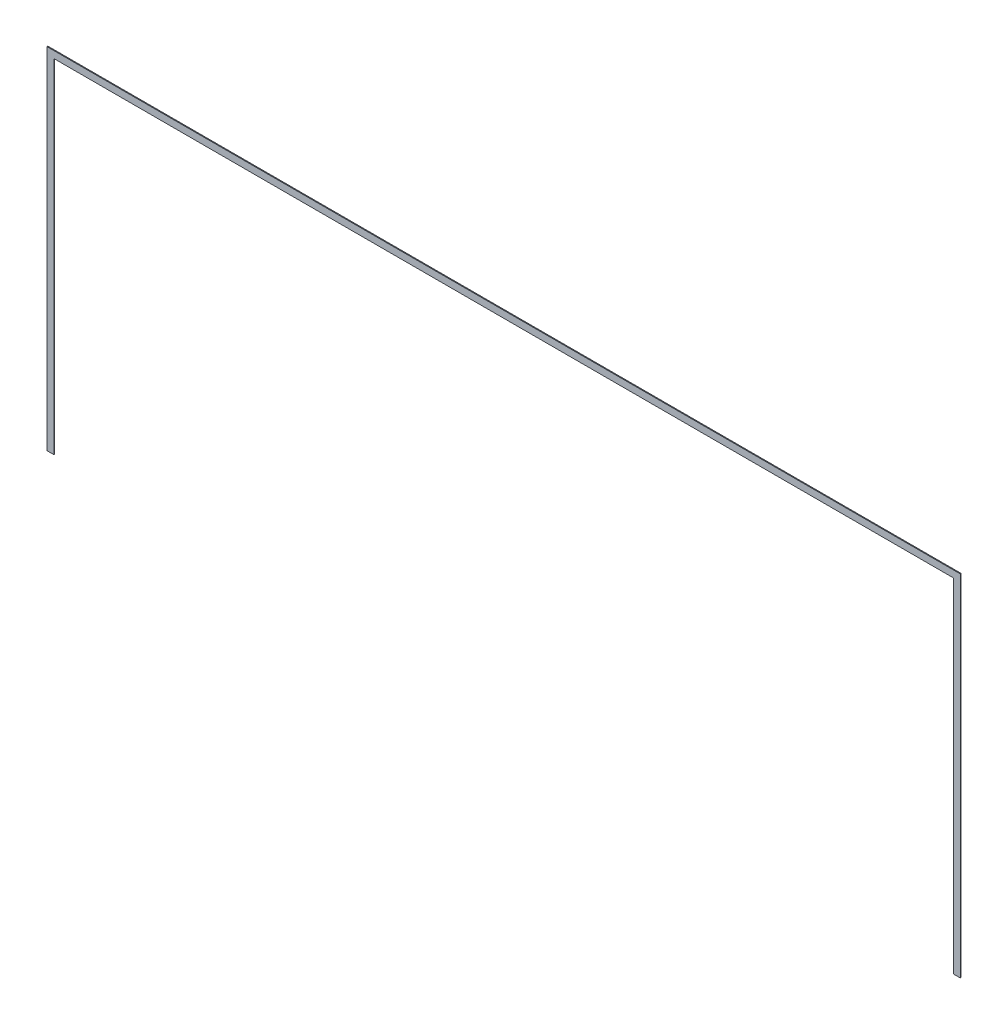
ISO-10303-21;
HEADER;
FILE_DESCRIPTION(('STEP AP214'),'2;1');
FILE_NAME('part.step','',(''),(''),'','','');
FILE_SCHEMA(('AUTOMOTIVE_DESIGN { 1 0 10303 214 1 1 1 1 }'));
ENDSEC;
DATA;
#1=APPLICATION_CONTEXT('core data for automotive mechanical design processes');
#2=APPLICATION_PROTOCOL_DEFINITION('international standard','automotive_design',2000,#1);
#3=PRODUCT_CONTEXT('',#1,'mechanical');
#4=PRODUCT('Part','Part','',(#3));
#5=PRODUCT_RELATED_PRODUCT_CATEGORY('part','',(#4));
#6=PRODUCT_DEFINITION_FORMATION('','',#4);
#7=PRODUCT_DEFINITION_CONTEXT('part definition',#1,'design');
#8=PRODUCT_DEFINITION('design','',#6,#7);
#9=PRODUCT_DEFINITION_SHAPE('','',#8);
#10=(LENGTH_UNIT() NAMED_UNIT(*) SI_UNIT(.MILLI.,.METRE.));
#11=(NAMED_UNIT(*) PLANE_ANGLE_UNIT() SI_UNIT($,.RADIAN.));
#12=(NAMED_UNIT(*) SI_UNIT($,.STERADIAN.) SOLID_ANGLE_UNIT());
#13=UNCERTAINTY_MEASURE_WITH_UNIT(LENGTH_MEASURE(1.E-05),#10,'distance_accuracy_value','');
#14=(GEOMETRIC_REPRESENTATION_CONTEXT(3) GLOBAL_UNCERTAINTY_ASSIGNED_CONTEXT((#13)) GLOBAL_UNIT_ASSIGNED_CONTEXT((#10,
#11,#12)) REPRESENTATION_CONTEXT('',''));
#15=CARTESIAN_POINT('',(0.,0.,0.));
#16=DIRECTION('',(0.,0.,1.));
#17=DIRECTION('',(1.,0.,0.));
#18=AXIS2_PLACEMENT_3D('',#15,#16,#17);
#19=CARTESIAN_POINT('',(-960.950136184693,7020.97074050903,0.));
#20=DIRECTION('',(0.,0.,1.));
#21=DIRECTION('',(1.,0.,0.));
#22=AXIS2_PLACEMENT_3D('',#19,#20,#21);
#23=PLANE('',#22);
#24=DIRECTION('',(1.,0.,0.));
#25=VECTOR('',#24,1.);
#26=CARTESIAN_POINT('',(-960.950136184693,8303.67074050903,0.));
#27=LINE('',#26,#25);
#28=CARTESIAN_POINT('',(2387.08736381531,8303.67074050903,0.));
#29=VERTEX_POINT('',#28);
#30=CARTESIAN_POINT('',(-4308.9876361847,8303.67074050903,0.));
#31=VERTEX_POINT('',#30);
#32=EDGE_CURVE('E124',#29,#31,#27,.F.);
#33=ORIENTED_EDGE('',*,*,#32,.F.);
#34=DIRECTION('',(0.,1.,0.));
#35=VECTOR('',#34,1.);
#36=CARTESIAN_POINT('',(2387.08736381531,7020.97074050903,0.));
#37=LINE('',#36,#35);
#38=CARTESIAN_POINT('',(2387.08736381531,5738.27074050903,0.));
#39=VERTEX_POINT('',#38);
#40=EDGE_CURVE('E119',#39,#29,#37,.T.);
#41=ORIENTED_EDGE('',*,*,#40,.F.);
#42=DIRECTION('',(1.,0.,0.));
#43=VECTOR('',#42,1.);
#44=CARTESIAN_POINT('',(2361.68736381531,5738.27074050903,0.));
#45=LINE('',#44,#43);
#46=CARTESIAN_POINT('',(2336.28736381531,5738.27074050903,0.));
#47=VERTEX_POINT('',#46);
#48=EDGE_CURVE('E113',#47,#39,#45,.T.);
#49=ORIENTED_EDGE('',*,*,#48,.F.);
#50=DIRECTION('',(0.,1.,0.));
#51=VECTOR('',#50,1.);
#52=CARTESIAN_POINT('',(2336.28736381531,6995.57074050903,0.));
#53=LINE('',#52,#51);
#54=CARTESIAN_POINT('',(2336.2873638153,8252.87074050903,0.));
#55=VERTEX_POINT('',#54);
#56=EDGE_CURVE('E107',#55,#47,#53,.F.);
#57=ORIENTED_EDGE('',*,*,#56,.F.);
#58=DIRECTION('',(1.,0.,0.));
#59=VECTOR('',#58,1.);
#60=CARTESIAN_POINT('',(-960.950136184693,8252.87074050903,0.));
#61=LINE('',#60,#59);
#62=CARTESIAN_POINT('',(-4258.1876361847,8252.87074050903,0.));
#63=VERTEX_POINT('',#62);
#64=EDGE_CURVE('E101',#63,#55,#61,.T.);
#65=ORIENTED_EDGE('',*,*,#64,.F.);
#66=DIRECTION('',(0.,1.,0.));
#67=VECTOR('',#66,1.);
#68=CARTESIAN_POINT('',(-4258.1876361847,6995.57074050903,0.));
#69=LINE('',#68,#67);
#70=CARTESIAN_POINT('',(-4258.1876361847,5738.27074050903,0.));
#71=VERTEX_POINT('',#70);
#72=EDGE_CURVE('E77',#71,#63,#69,.T.);
#73=ORIENTED_EDGE('',*,*,#72,.F.);
#74=DIRECTION('',(1.,0.,0.));
#75=VECTOR('',#74,1.);
#76=CARTESIAN_POINT('',(-4283.5876361847,5738.27074050903,0.));
#77=LINE('',#76,#75);
#78=CARTESIAN_POINT('',(-4308.9876361847,5738.27074050903,0.));
#79=VERTEX_POINT('',#78);
#80=EDGE_CURVE('E79',#79,#71,#77,.T.);
#81=ORIENTED_EDGE('',*,*,#80,.F.);
#82=DIRECTION('',(0.,1.,0.));
#83=VECTOR('',#82,1.);
#84=CARTESIAN_POINT('',(-4308.9876361847,7020.97074050903,0.));
#85=LINE('',#84,#83);
#86=EDGE_CURVE('E17',#31,#79,#85,.F.);
#87=ORIENTED_EDGE('',*,*,#86,.F.);
#88=EDGE_LOOP('',(#33,#41,#49,#57,#65,#73,#81,#87));
#89=FACE_BOUND('',#88,.T.);
#90=ADVANCED_FACE('F14',(#89),#23,.F.);
#91=CARTESIAN_POINT('',(-4308.9876361847,7020.97074050903,6.35));
#92=DIRECTION('',(-1.,0.,0.));
#93=DIRECTION('',(0.,0.,1.));
#94=AXIS2_PLACEMENT_3D('',#91,#92,#93);
#95=PLANE('',#94);
#96=DIRECTION('',(0.,1.,0.));
#97=VECTOR('',#96,1.);
#98=CARTESIAN_POINT('',(-4308.9876361847,7020.97074050903,6.35));
#99=LINE('',#98,#97);
#100=CARTESIAN_POINT('',(-4308.9876361847,8303.67074050903,6.35));
#101=VERTEX_POINT('',#100);
#102=CARTESIAN_POINT('',(-4308.9876361847,5738.27074050903,6.35));
#103=VERTEX_POINT('',#102);
#104=EDGE_CURVE('E128',#101,#103,#99,.F.);
#105=ORIENTED_EDGE('',*,*,#104,.F.);
#106=DIRECTION('',(0.,0.,1.));
#107=VECTOR('',#106,1.);
#108=CARTESIAN_POINT('',(-4308.9876361847,8303.67074050903,6.35));
#109=LINE('',#108,#107);
#110=EDGE_CURVE('E90',#31,#101,#109,.T.);
#111=ORIENTED_EDGE('',*,*,#110,.F.);
#112=ORIENTED_EDGE('',*,*,#86,.T.);
#113=DIRECTION('',(0.,0.,-1.));
#114=VECTOR('',#113,1.);
#115=CARTESIAN_POINT('',(-4308.9876361847,5738.27074050903,6.35));
#116=LINE('',#115,#114);
#117=EDGE_CURVE('E85',#103,#79,#116,.T.);
#118=ORIENTED_EDGE('',*,*,#117,.F.);
#119=EDGE_LOOP('',(#105,#111,#112,#118));
#120=FACE_BOUND('',#119,.T.);
#121=ADVANCED_FACE('F87',(#120),#95,.T.);
#122=CARTESIAN_POINT('',(-4283.5876361847,5738.27074050903,6.35));
#123=DIRECTION('',(0.,-1.,0.));
#124=DIRECTION('',(0.,0.,-1.));
#125=AXIS2_PLACEMENT_3D('',#122,#123,#124);
#126=PLANE('',#125);
#127=DIRECTION('',(1.,0.,0.));
#128=VECTOR('',#127,1.);
#129=CARTESIAN_POINT('',(-960.950136184693,5738.27074050903,6.35));
#130=LINE('',#129,#128);
#131=CARTESIAN_POINT('',(-4258.1876361847,5738.27074050903,6.35));
#132=VERTEX_POINT('',#131);
#133=EDGE_CURVE('E94',#103,#132,#130,.T.);
#134=ORIENTED_EDGE('',*,*,#133,.F.);
#135=ORIENTED_EDGE('',*,*,#117,.T.);
#136=ORIENTED_EDGE('',*,*,#80,.T.);
#137=DIRECTION('',(0.,0.,-1.));
#138=VECTOR('',#137,1.);
#139=CARTESIAN_POINT('',(-4258.1876361847,5738.27074050903,6.35));
#140=LINE('',#139,#138);
#141=EDGE_CURVE('E97',#132,#71,#140,.T.);
#142=ORIENTED_EDGE('',*,*,#141,.F.);
#143=EDGE_LOOP('',(#134,#135,#136,#142));
#144=FACE_BOUND('',#143,.T.);
#145=ADVANCED_FACE('F92',(#144),#126,.T.);
#146=CARTESIAN_POINT('',(-4258.1876361847,6995.57074050903,6.35));
#147=DIRECTION('',(1.,0.,0.));
#148=DIRECTION('',(0.,0.,-1.));
#149=AXIS2_PLACEMENT_3D('',#146,#147,#148);
#150=PLANE('',#149);
#151=DIRECTION('',(0.,1.,0.));
#152=VECTOR('',#151,1.);
#153=CARTESIAN_POINT('',(-4258.1876361847,7020.97074050903,6.35));
#154=LINE('',#153,#152);
#155=CARTESIAN_POINT('',(-4258.1876361847,8252.87074050903,6.35));
#156=VERTEX_POINT('',#155);
#157=EDGE_CURVE('E131',#132,#156,#154,.T.);
#158=ORIENTED_EDGE('',*,*,#157,.F.);
#159=ORIENTED_EDGE('',*,*,#141,.T.);
#160=ORIENTED_EDGE('',*,*,#72,.T.);
#161=DIRECTION('',(0.,0.,-1.));
#162=VECTOR('',#161,1.);
#163=CARTESIAN_POINT('',(-4258.1876361847,8252.87074050903,6.35));
#164=LINE('',#163,#162);
#165=EDGE_CURVE('E104',#156,#63,#164,.T.);
#166=ORIENTED_EDGE('',*,*,#165,.F.);
#167=EDGE_LOOP('',(#158,#159,#160,#166));
#168=FACE_BOUND('',#167,.T.);
#169=ADVANCED_FACE('F158',(#168),#150,.T.);
#170=CARTESIAN_POINT('',(-960.950136184693,8252.87074050903,6.35));
#171=DIRECTION('',(0.,-1.,0.));
#172=DIRECTION('',(0.,0.,-1.));
#173=AXIS2_PLACEMENT_3D('',#170,#171,#172);
#174=PLANE('',#173);
#175=DIRECTION('',(1.,0.,0.));
#176=VECTOR('',#175,1.);
#177=CARTESIAN_POINT('',(-960.950136184693,8252.87074050903,6.35));
#178=LINE('',#177,#176);
#179=CARTESIAN_POINT('',(2336.2873638153,8252.87074050903,6.35));
#180=VERTEX_POINT('',#179);
#181=EDGE_CURVE('E134',#156,#180,#178,.T.);
#182=ORIENTED_EDGE('',*,*,#181,.F.);
#183=ORIENTED_EDGE('',*,*,#165,.T.);
#184=ORIENTED_EDGE('',*,*,#64,.T.);
#185=DIRECTION('',(0.,0.,1.));
#186=VECTOR('',#185,1.);
#187=CARTESIAN_POINT('',(2336.28736381531,8252.87074050903,6.35));
#188=LINE('',#187,#186);
#189=EDGE_CURVE('E110',#180,#55,#188,.F.);
#190=ORIENTED_EDGE('',*,*,#189,.F.);
#191=EDGE_LOOP('',(#182,#183,#184,#190));
#192=FACE_BOUND('',#191,.T.);
#193=ADVANCED_FACE('F155',(#192),#174,.T.);
#194=CARTESIAN_POINT('',(2336.28736381531,6995.57074050903,6.35));
#195=DIRECTION('',(-1.,0.,0.));
#196=DIRECTION('',(0.,0.,1.));
#197=AXIS2_PLACEMENT_3D('',#194,#195,#196);
#198=PLANE('',#197);
#199=DIRECTION('',(0.,1.,0.));
#200=VECTOR('',#199,1.);
#201=CARTESIAN_POINT('',(2336.2873638153,7020.97074050903,6.35));
#202=LINE('',#201,#200);
#203=CARTESIAN_POINT('',(2336.28736381531,5738.27074050903,6.35));
#204=VERTEX_POINT('',#203);
#205=EDGE_CURVE('E137',#180,#204,#202,.F.);
#206=ORIENTED_EDGE('',*,*,#205,.F.);
#207=ORIENTED_EDGE('',*,*,#189,.T.);
#208=ORIENTED_EDGE('',*,*,#56,.T.);
#209=DIRECTION('',(0.,0.,-1.));
#210=VECTOR('',#209,1.);
#211=CARTESIAN_POINT('',(2336.28736381531,5738.27074050903,6.35));
#212=LINE('',#211,#210);
#213=EDGE_CURVE('E116',#204,#47,#212,.T.);
#214=ORIENTED_EDGE('',*,*,#213,.F.);
#215=EDGE_LOOP('',(#206,#207,#208,#214));
#216=FACE_BOUND('',#215,.T.);
#217=ADVANCED_FACE('F152',(#216),#198,.T.);
#218=CARTESIAN_POINT('',(2361.68736381531,5738.27074050903,6.35));
#219=DIRECTION('',(0.,-1.,0.));
#220=DIRECTION('',(0.,0.,-1.));
#221=AXIS2_PLACEMENT_3D('',#218,#219,#220);
#222=PLANE('',#221);
#223=DIRECTION('',(1.,0.,0.));
#224=VECTOR('',#223,1.);
#225=CARTESIAN_POINT('',(-960.950136184693,5738.27074050903,6.35));
#226=LINE('',#225,#224);
#227=CARTESIAN_POINT('',(2387.08736381531,5738.27074050903,6.35));
#228=VERTEX_POINT('',#227);
#229=EDGE_CURVE('E140',#204,#228,#226,.T.);
#230=ORIENTED_EDGE('',*,*,#229,.F.);
#231=ORIENTED_EDGE('',*,*,#213,.T.);
#232=ORIENTED_EDGE('',*,*,#48,.T.);
#233=DIRECTION('',(0.,0.,-1.));
#234=VECTOR('',#233,1.);
#235=CARTESIAN_POINT('',(2387.08736381531,5738.27074050903,6.35));
#236=LINE('',#235,#234);
#237=EDGE_CURVE('E121',#228,#39,#236,.T.);
#238=ORIENTED_EDGE('',*,*,#237,.F.);
#239=EDGE_LOOP('',(#230,#231,#232,#238));
#240=FACE_BOUND('',#239,.T.);
#241=ADVANCED_FACE('F149',(#240),#222,.T.);
#242=CARTESIAN_POINT('',(2387.08736381531,7020.97074050903,6.35));
#243=DIRECTION('',(1.,0.,0.));
#244=DIRECTION('',(0.,0.,-1.));
#245=AXIS2_PLACEMENT_3D('',#242,#243,#244);
#246=PLANE('',#245);
#247=DIRECTION('',(0.,1.,0.));
#248=VECTOR('',#247,1.);
#249=CARTESIAN_POINT('',(2387.08736381531,7020.97074050903,6.35));
#250=LINE('',#249,#248);
#251=CARTESIAN_POINT('',(2387.08736381531,8303.67074050903,6.35));
#252=VERTEX_POINT('',#251);
#253=EDGE_CURVE('E23',#228,#252,#250,.T.);
#254=ORIENTED_EDGE('',*,*,#253,.F.);
#255=ORIENTED_EDGE('',*,*,#237,.T.);
#256=ORIENTED_EDGE('',*,*,#40,.T.);
#257=DIRECTION('',(0.,0.,1.));
#258=VECTOR('',#257,1.);
#259=CARTESIAN_POINT('',(2387.08736381531,8303.67074050903,6.35));
#260=LINE('',#259,#258);
#261=EDGE_CURVE('E32',#252,#29,#260,.F.);
#262=ORIENTED_EDGE('',*,*,#261,.F.);
#263=EDGE_LOOP('',(#254,#255,#256,#262));
#264=FACE_BOUND('',#263,.T.);
#265=ADVANCED_FACE('F147',(#264),#246,.T.);
#266=CARTESIAN_POINT('',(-960.950136184693,8303.67074050903,6.35));
#267=DIRECTION('',(0.,1.,0.));
#268=DIRECTION('',(0.,0.,1.));
#269=AXIS2_PLACEMENT_3D('',#266,#267,#268);
#270=PLANE('',#269);
#271=DIRECTION('',(1.,0.,0.));
#272=VECTOR('',#271,1.);
#273=CARTESIAN_POINT('',(-960.950136184693,8303.67074050903,6.35));
#274=LINE('',#273,#272);
#275=EDGE_CURVE('E9',#252,#101,#274,.F.);
#276=ORIENTED_EDGE('',*,*,#275,.F.);
#277=ORIENTED_EDGE('',*,*,#261,.T.);
#278=ORIENTED_EDGE('',*,*,#32,.T.);
#279=ORIENTED_EDGE('',*,*,#110,.T.);
#280=EDGE_LOOP('',(#276,#277,#278,#279));
#281=FACE_BOUND('',#280,.T.);
#282=ADVANCED_FACE('F160',(#281),#270,.T.);
#283=CARTESIAN_POINT('',(-960.950136184693,7020.97074050903,6.35));
#284=DIRECTION('',(0.,0.,1.));
#285=DIRECTION('',(1.,0.,0.));
#286=AXIS2_PLACEMENT_3D('',#283,#284,#285);
#287=PLANE('',#286);
#288=ORIENTED_EDGE('',*,*,#253,.T.);
#289=ORIENTED_EDGE('',*,*,#275,.T.);
#290=ORIENTED_EDGE('',*,*,#104,.T.);
#291=ORIENTED_EDGE('',*,*,#133,.T.);
#292=ORIENTED_EDGE('',*,*,#157,.T.);
#293=ORIENTED_EDGE('',*,*,#181,.T.);
#294=ORIENTED_EDGE('',*,*,#205,.T.);
#295=ORIENTED_EDGE('',*,*,#229,.T.);
#296=EDGE_LOOP('',(#288,#289,#290,#291,#292,#293,#294,#295));
#297=FACE_BOUND('',#296,.T.);
#298=ADVANCED_FACE('F145',(#297),#287,.T.);
#299=CLOSED_SHELL('',(#90,#121,#145,#169,#193,#217,#241,#265,#282,#298));
#300=MANIFOLD_SOLID_BREP('B1',#299);
#301=ADVANCED_BREP_SHAPE_REPRESENTATION('',(#18,#300),#14);
#302=SHAPE_DEFINITION_REPRESENTATION(#9,#301);
ENDSEC;
END-ISO-10303-21;
